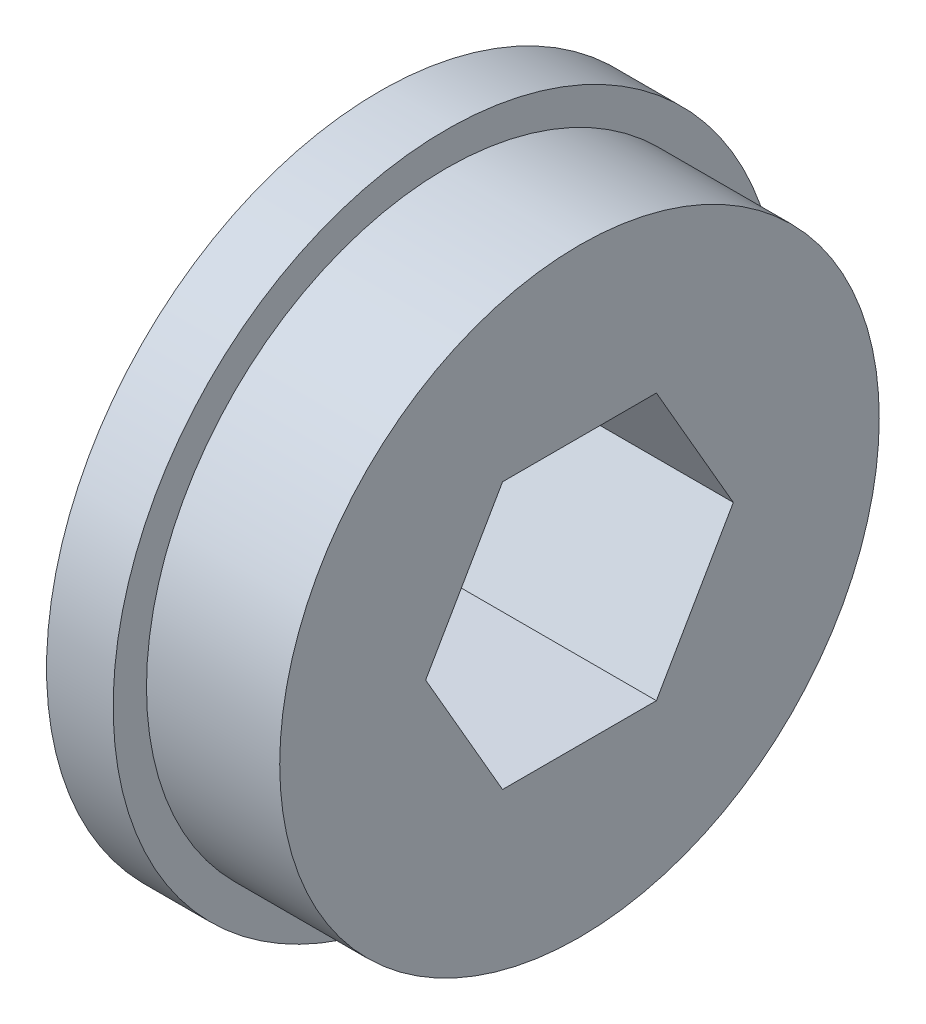
ISO-10303-21;
HEADER;
FILE_DESCRIPTION(('STEP AP214'),'2;1');
FILE_NAME('part.step','',(''),(''),'','','');
FILE_SCHEMA(('AUTOMOTIVE_DESIGN { 1 0 10303 214 1 1 1 1 }'));
ENDSEC;
DATA;
#1=APPLICATION_CONTEXT('core data for automotive mechanical design processes');
#2=APPLICATION_PROTOCOL_DEFINITION('international standard','automotive_design',2000,#1);
#3=PRODUCT_CONTEXT('',#1,'mechanical');
#4=PRODUCT('Part','Part','',(#3));
#5=PRODUCT_RELATED_PRODUCT_CATEGORY('part','',(#4));
#6=PRODUCT_DEFINITION_FORMATION('','',#4);
#7=PRODUCT_DEFINITION_CONTEXT('part definition',#1,'design');
#8=PRODUCT_DEFINITION('design','',#6,#7);
#9=PRODUCT_DEFINITION_SHAPE('','',#8);
#10=(LENGTH_UNIT() NAMED_UNIT(*) SI_UNIT(.MILLI.,.METRE.));
#11=(NAMED_UNIT(*) PLANE_ANGLE_UNIT() SI_UNIT($,.RADIAN.));
#12=(NAMED_UNIT(*) SI_UNIT($,.STERADIAN.) SOLID_ANGLE_UNIT());
#13=UNCERTAINTY_MEASURE_WITH_UNIT(LENGTH_MEASURE(1.E-05),#10,'distance_accuracy_value','');
#14=(GEOMETRIC_REPRESENTATION_CONTEXT(3) GLOBAL_UNCERTAINTY_ASSIGNED_CONTEXT((#13)) GLOBAL_UNIT_ASSIGNED_CONTEXT((#10,
#11,#12)) REPRESENTATION_CONTEXT('',''));
#15=CARTESIAN_POINT('',(0.,0.,0.));
#16=DIRECTION('',(0.,0.,1.));
#17=DIRECTION('',(1.,0.,0.));
#18=AXIS2_PLACEMENT_3D('',#15,#16,#17);
#19=CARTESIAN_POINT('',(3.175,0.,0.));
#20=DIRECTION('',(-1.,0.,0.));
#21=DIRECTION('',(0.,0.,1.));
#22=AXIS2_PLACEMENT_3D('',#19,#20,#21);
#23=CYLINDRICAL_SURFACE('',#22,15.875);
#24=CARTESIAN_POINT('',(3.175,0.,0.));
#25=DIRECTION('',(1.,0.,0.));
#26=DIRECTION('',(0.,0.,-1.));
#27=AXIS2_PLACEMENT_3D('',#24,#25,#26);
#28=CIRCLE('',#27,15.875);
#29=CARTESIAN_POINT('',(3.175,0.,-15.875));
#30=VERTEX_POINT('',#29);
#31=EDGE_CURVE('E41',#30,#30,#28,.T.);
#32=ORIENTED_EDGE('',*,*,#31,.F.);
#33=EDGE_LOOP('',(#32));
#34=FACE_BOUND('',#33,.T.);
#35=CARTESIAN_POINT('',(0.,0.,0.));
#36=DIRECTION('',(1.,0.,0.));
#37=DIRECTION('',(0.,0.,-1.));
#38=AXIS2_PLACEMENT_3D('',#35,#36,#37);
#39=CIRCLE('',#38,15.875);
#40=CARTESIAN_POINT('',(0.,0.,-15.875));
#41=VERTEX_POINT('',#40);
#42=EDGE_CURVE('E36',#41,#41,#39,.T.);
#43=ORIENTED_EDGE('',*,*,#42,.T.);
#44=EDGE_LOOP('',(#43));
#45=FACE_BOUND('',#44,.T.);
#46=ADVANCED_FACE('F33',(#34,#45),#23,.T.);
#47=CARTESIAN_POINT('',(3.175,0.,0.));
#48=DIRECTION('',(1.,0.,0.));
#49=DIRECTION('',(0.,0.,-1.));
#50=AXIS2_PLACEMENT_3D('',#47,#48,#49);
#51=PLANE('',#50);
#52=CARTESIAN_POINT('',(3.175,0.,0.));
#53=DIRECTION('',(1.,0.,0.));
#54=DIRECTION('',(0.,0.,-1.));
#55=AXIS2_PLACEMENT_3D('',#52,#53,#54);
#56=CIRCLE('',#55,14.2875);
#57=CARTESIAN_POINT('',(3.175,0.,-14.2875));
#58=VERTEX_POINT('',#57);
#59=EDGE_CURVE('E11',#58,#58,#56,.T.);
#60=ORIENTED_EDGE('',*,*,#59,.F.);
#61=EDGE_LOOP('',(#60));
#62=FACE_BOUND('',#61,.T.);
#63=ORIENTED_EDGE('',*,*,#31,.T.);
#64=EDGE_LOOP('',(#63));
#65=FACE_BOUND('',#64,.T.);
#66=ADVANCED_FACE('F149',(#62,#65),#51,.T.);
#67=CARTESIAN_POINT('',(0.,0.,0.));
#68=DIRECTION('',(1.,0.,0.));
#69=DIRECTION('',(0.,0.,-1.));
#70=AXIS2_PLACEMENT_3D('',#67,#68,#69);
#71=PLANE('',#70);
#72=DIRECTION('',(0.,0.,-1.));
#73=VECTOR('',#72,1.);
#74=CARTESIAN_POINT('',(0.,-6.35000000000001,3.66617420935413));
#75=LINE('',#74,#73);
#76=CARTESIAN_POINT('',(0.,-6.35000000000001,3.66617420935413));
#77=VERTEX_POINT('',#76);
#78=CARTESIAN_POINT('',(0.,-6.35000000000001,-3.66617420935412));
#79=VERTEX_POINT('',#78);
#80=EDGE_CURVE('E95',#77,#79,#75,.T.);
#81=ORIENTED_EDGE('',*,*,#80,.T.);
#82=DIRECTION('',(0.,0.866025403784439,-0.5));
#83=VECTOR('',#82,1.);
#84=CARTESIAN_POINT('',(0.,-6.35000000000001,-3.66617420935412));
#85=LINE('',#84,#83);
#86=CARTESIAN_POINT('',(0.,0.,-7.33234841870825));
#87=VERTEX_POINT('',#86);
#88=EDGE_CURVE('E89',#79,#87,#85,.T.);
#89=ORIENTED_EDGE('',*,*,#88,.T.);
#90=DIRECTION('',(0.,0.866025403784439,0.5));
#91=VECTOR('',#90,1.);
#92=CARTESIAN_POINT('',(0.,0.,-7.33234841870825));
#93=LINE('',#92,#91);
#94=CARTESIAN_POINT('',(0.,6.35000000000001,-3.66617420935412));
#95=VERTEX_POINT('',#94);
#96=EDGE_CURVE('E98',#87,#95,#93,.T.);
#97=ORIENTED_EDGE('',*,*,#96,.T.);
#98=DIRECTION('',(0.,0.,1.));
#99=VECTOR('',#98,1.);
#100=CARTESIAN_POINT('',(0.,6.35000000000001,-3.66617420935412));
#101=LINE('',#100,#99);
#102=CARTESIAN_POINT('',(0.,6.35000000000001,3.66617420935413));
#103=VERTEX_POINT('',#102);
#104=EDGE_CURVE('E49',#95,#103,#101,.T.);
#105=ORIENTED_EDGE('',*,*,#104,.T.);
#106=DIRECTION('',(0.,-0.866025403784439,0.5));
#107=VECTOR('',#106,1.);
#108=CARTESIAN_POINT('',(0.,6.35000000000001,3.66617420935413));
#109=LINE('',#108,#107);
#110=CARTESIAN_POINT('',(0.,0.,7.33234841870826));
#111=VERTEX_POINT('',#110);
#112=EDGE_CURVE('E113',#103,#111,#109,.T.);
#113=ORIENTED_EDGE('',*,*,#112,.T.);
#114=DIRECTION('',(0.,-0.866025403784438,-0.5));
#115=VECTOR('',#114,1.);
#116=CARTESIAN_POINT('',(0.,0.,7.33234841870826));
#117=LINE('',#116,#115);
#118=EDGE_CURVE('E116',#111,#77,#117,.T.);
#119=ORIENTED_EDGE('',*,*,#118,.T.);
#120=EDGE_LOOP('',(#81,#89,#97,#105,#113,#119));
#121=FACE_BOUND('',#120,.T.);
#122=ORIENTED_EDGE('',*,*,#42,.F.);
#123=EDGE_LOOP('',(#122));
#124=FACE_BOUND('',#123,.T.);
#125=ADVANCED_FACE('F102',(#121,#124),#71,.F.);
#126=CARTESIAN_POINT('',(9.525,0.,0.));
#127=DIRECTION('',(-1.,0.,0.));
#128=DIRECTION('',(0.,0.,1.));
#129=AXIS2_PLACEMENT_3D('',#126,#127,#128);
#130=CYLINDRICAL_SURFACE('',#129,14.2875);
#131=CARTESIAN_POINT('',(9.525,0.,0.));
#132=DIRECTION('',(1.,0.,0.));
#133=DIRECTION('',(0.,0.,-1.));
#134=AXIS2_PLACEMENT_3D('',#131,#132,#133);
#135=CIRCLE('',#134,14.2875);
#136=CARTESIAN_POINT('',(9.525,0.,-14.2875));
#137=VERTEX_POINT('',#136);
#138=EDGE_CURVE('E132',#137,#137,#135,.T.);
#139=ORIENTED_EDGE('',*,*,#138,.F.);
#140=EDGE_LOOP('',(#139));
#141=FACE_BOUND('',#140,.T.);
#142=ORIENTED_EDGE('',*,*,#59,.T.);
#143=EDGE_LOOP('',(#142));
#144=FACE_BOUND('',#143,.T.);
#145=ADVANCED_FACE('F148',(#141,#144),#130,.T.);
#146=CARTESIAN_POINT('',(9.525,0.,0.));
#147=DIRECTION('',(1.,0.,0.));
#148=DIRECTION('',(0.,0.,-1.));
#149=AXIS2_PLACEMENT_3D('',#146,#147,#148);
#150=PLANE('',#149);
#151=DIRECTION('',(0.,0.866025403784439,-0.5));
#152=VECTOR('',#151,1.);
#153=CARTESIAN_POINT('',(9.525,-6.35000000000001,-3.66617420935412));
#154=LINE('',#153,#152);
#155=CARTESIAN_POINT('',(9.525,-6.35000000000001,-3.66617420935412));
#156=VERTEX_POINT('',#155);
#157=CARTESIAN_POINT('',(9.525,0.,-7.33234841870825));
#158=VERTEX_POINT('',#157);
#159=EDGE_CURVE('E57',#156,#158,#154,.T.);
#160=ORIENTED_EDGE('',*,*,#159,.F.);
#161=DIRECTION('',(0.,0.,-1.));
#162=VECTOR('',#161,1.);
#163=CARTESIAN_POINT('',(9.525,-6.35000000000001,3.66617420935413));
#164=LINE('',#163,#162);
#165=CARTESIAN_POINT('',(9.525,-6.35000000000001,3.66617420935413));
#166=VERTEX_POINT('',#165);
#167=EDGE_CURVE('E106',#166,#156,#164,.T.);
#168=ORIENTED_EDGE('',*,*,#167,.F.);
#169=DIRECTION('',(0.,-0.866025403784438,-0.5));
#170=VECTOR('',#169,1.);
#171=CARTESIAN_POINT('',(9.525,0.,7.33234841870826));
#172=LINE('',#171,#170);
#173=CARTESIAN_POINT('',(9.525,0.,7.33234841870826));
#174=VERTEX_POINT('',#173);
#175=EDGE_CURVE('E109',#174,#166,#172,.T.);
#176=ORIENTED_EDGE('',*,*,#175,.F.);
#177=DIRECTION('',(0.,-0.866025403784439,0.5));
#178=VECTOR('',#177,1.);
#179=CARTESIAN_POINT('',(9.525,6.35000000000001,3.66617420935413));
#180=LINE('',#179,#178);
#181=CARTESIAN_POINT('',(9.525,6.35000000000001,3.66617420935413));
#182=VERTEX_POINT('',#181);
#183=EDGE_CURVE('E125',#182,#174,#180,.T.);
#184=ORIENTED_EDGE('',*,*,#183,.F.);
#185=DIRECTION('',(0.,0.,1.));
#186=VECTOR('',#185,1.);
#187=CARTESIAN_POINT('',(9.525,6.35000000000001,-3.66617420935412));
#188=LINE('',#187,#186);
#189=CARTESIAN_POINT('',(9.525,6.35000000000001,-3.66617420935412));
#190=VERTEX_POINT('',#189);
#191=EDGE_CURVE('E122',#190,#182,#188,.T.);
#192=ORIENTED_EDGE('',*,*,#191,.F.);
#193=DIRECTION('',(0.,0.866025403784439,0.5));
#194=VECTOR('',#193,1.);
#195=CARTESIAN_POINT('',(9.525,0.,-7.33234841870825));
#196=LINE('',#195,#194);
#197=EDGE_CURVE('E120',#158,#190,#196,.T.);
#198=ORIENTED_EDGE('',*,*,#197,.F.);
#199=EDGE_LOOP('',(#160,#168,#176,#184,#192,#198));
#200=FACE_BOUND('',#199,.T.);
#201=ORIENTED_EDGE('',*,*,#138,.T.);
#202=EDGE_LOOP('',(#201));
#203=FACE_BOUND('',#202,.T.);
#204=ADVANCED_FACE('F154',(#200,#203),#150,.T.);
#205=CARTESIAN_POINT('',(0.,-6.35000000000001,-3.66617420935412));
#206=DIRECTION('',(0.,-0.5,-0.866025403784439));
#207=DIRECTION('',(0.,0.866025403784439,-0.5));
#208=AXIS2_PLACEMENT_3D('',#205,#206,#207);
#209=PLANE('',#208);
#210=ORIENTED_EDGE('',*,*,#159,.T.);
#211=DIRECTION('',(1.,0.,0.));
#212=VECTOR('',#211,1.);
#213=CARTESIAN_POINT('',(0.,0.,-7.33234841870825));
#214=LINE('',#213,#212);
#215=EDGE_CURVE('E85',#87,#158,#214,.T.);
#216=ORIENTED_EDGE('',*,*,#215,.F.);
#217=ORIENTED_EDGE('',*,*,#88,.F.);
#218=DIRECTION('',(1.,0.,0.));
#219=VECTOR('',#218,1.);
#220=CARTESIAN_POINT('',(0.,-6.35000000000001,-3.66617420935412));
#221=LINE('',#220,#219);
#222=EDGE_CURVE('E130',#79,#156,#221,.T.);
#223=ORIENTED_EDGE('',*,*,#222,.T.);
#224=EDGE_LOOP('',(#210,#216,#217,#223));
#225=FACE_BOUND('',#224,.T.);
#226=ADVANCED_FACE('F87',(#225),#209,.F.);
#227=CARTESIAN_POINT('',(0.,-6.35000000000001,3.66617420935413));
#228=DIRECTION('',(0.,-1.,0.));
#229=DIRECTION('',(0.,0.,-1.));
#230=AXIS2_PLACEMENT_3D('',#227,#228,#229);
#231=PLANE('',#230);
#232=ORIENTED_EDGE('',*,*,#167,.T.);
#233=ORIENTED_EDGE('',*,*,#222,.F.);
#234=ORIENTED_EDGE('',*,*,#80,.F.);
#235=DIRECTION('',(1.,0.,0.));
#236=VECTOR('',#235,1.);
#237=CARTESIAN_POINT('',(0.,-6.35000000000001,3.66617420935413));
#238=LINE('',#237,#236);
#239=EDGE_CURVE('E133',#77,#166,#238,.T.);
#240=ORIENTED_EDGE('',*,*,#239,.T.);
#241=EDGE_LOOP('',(#232,#233,#234,#240));
#242=FACE_BOUND('',#241,.T.);
#243=ADVANCED_FACE('F195',(#242),#231,.F.);
#244=CARTESIAN_POINT('',(0.,0.,7.33234841870826));
#245=DIRECTION('',(0.,-0.5,0.866025403784439));
#246=DIRECTION('',(0.,-0.866025403784439,-0.5));
#247=AXIS2_PLACEMENT_3D('',#244,#245,#246);
#248=PLANE('',#247);
#249=ORIENTED_EDGE('',*,*,#175,.T.);
#250=ORIENTED_EDGE('',*,*,#239,.F.);
#251=ORIENTED_EDGE('',*,*,#118,.F.);
#252=DIRECTION('',(1.,0.,0.));
#253=VECTOR('',#252,1.);
#254=CARTESIAN_POINT('',(0.,0.,7.33234841870826));
#255=LINE('',#254,#253);
#256=EDGE_CURVE('E135',#111,#174,#255,.T.);
#257=ORIENTED_EDGE('',*,*,#256,.T.);
#258=EDGE_LOOP('',(#249,#250,#251,#257));
#259=FACE_BOUND('',#258,.T.);
#260=ADVANCED_FACE('F204',(#259),#248,.F.);
#261=CARTESIAN_POINT('',(0.,6.35000000000001,3.66617420935413));
#262=DIRECTION('',(0.,0.5,0.866025403784439));
#263=DIRECTION('',(0.,-0.866025403784439,0.5));
#264=AXIS2_PLACEMENT_3D('',#261,#262,#263);
#265=PLANE('',#264);
#266=ORIENTED_EDGE('',*,*,#183,.T.);
#267=ORIENTED_EDGE('',*,*,#256,.F.);
#268=ORIENTED_EDGE('',*,*,#112,.F.);
#269=DIRECTION('',(1.,0.,0.));
#270=VECTOR('',#269,1.);
#271=CARTESIAN_POINT('',(0.,6.35000000000001,3.66617420935413));
#272=LINE('',#271,#270);
#273=EDGE_CURVE('E137',#103,#182,#272,.T.);
#274=ORIENTED_EDGE('',*,*,#273,.T.);
#275=EDGE_LOOP('',(#266,#267,#268,#274));
#276=FACE_BOUND('',#275,.T.);
#277=ADVANCED_FACE('F214',(#276),#265,.F.);
#278=CARTESIAN_POINT('',(0.,6.35000000000001,-3.66617420935412));
#279=DIRECTION('',(0.,1.,0.));
#280=DIRECTION('',(0.,0.,1.));
#281=AXIS2_PLACEMENT_3D('',#278,#279,#280);
#282=PLANE('',#281);
#283=ORIENTED_EDGE('',*,*,#191,.T.);
#284=ORIENTED_EDGE('',*,*,#273,.F.);
#285=ORIENTED_EDGE('',*,*,#104,.F.);
#286=DIRECTION('',(1.,0.,0.));
#287=VECTOR('',#286,1.);
#288=CARTESIAN_POINT('',(0.,6.35000000000001,-3.66617420935412));
#289=LINE('',#288,#287);
#290=EDGE_CURVE('E94',#95,#190,#289,.T.);
#291=ORIENTED_EDGE('',*,*,#290,.T.);
#292=EDGE_LOOP('',(#283,#284,#285,#291));
#293=FACE_BOUND('',#292,.T.);
#294=ADVANCED_FACE('F224',(#293),#282,.F.);
#295=CARTESIAN_POINT('',(0.,0.,-7.33234841870825));
#296=DIRECTION('',(0.,0.5,-0.866025403784439));
#297=DIRECTION('',(0.,0.866025403784439,0.5));
#298=AXIS2_PLACEMENT_3D('',#295,#296,#297);
#299=PLANE('',#298);
#300=ORIENTED_EDGE('',*,*,#197,.T.);
#301=ORIENTED_EDGE('',*,*,#290,.F.);
#302=ORIENTED_EDGE('',*,*,#96,.F.);
#303=ORIENTED_EDGE('',*,*,#215,.T.);
#304=EDGE_LOOP('',(#300,#301,#302,#303));
#305=FACE_BOUND('',#304,.T.);
#306=ADVANCED_FACE('F99',(#305),#299,.F.);
#307=CLOSED_SHELL('',(#46,#66,#125,#145,#204,#226,#243,#260,#277,#294,#306));
#308=MANIFOLD_SOLID_BREP('B2',#307);
#309=ADVANCED_BREP_SHAPE_REPRESENTATION('',(#18,#308),#14);
#310=SHAPE_DEFINITION_REPRESENTATION(#9,#309);
ENDSEC;
END-ISO-10303-21;
